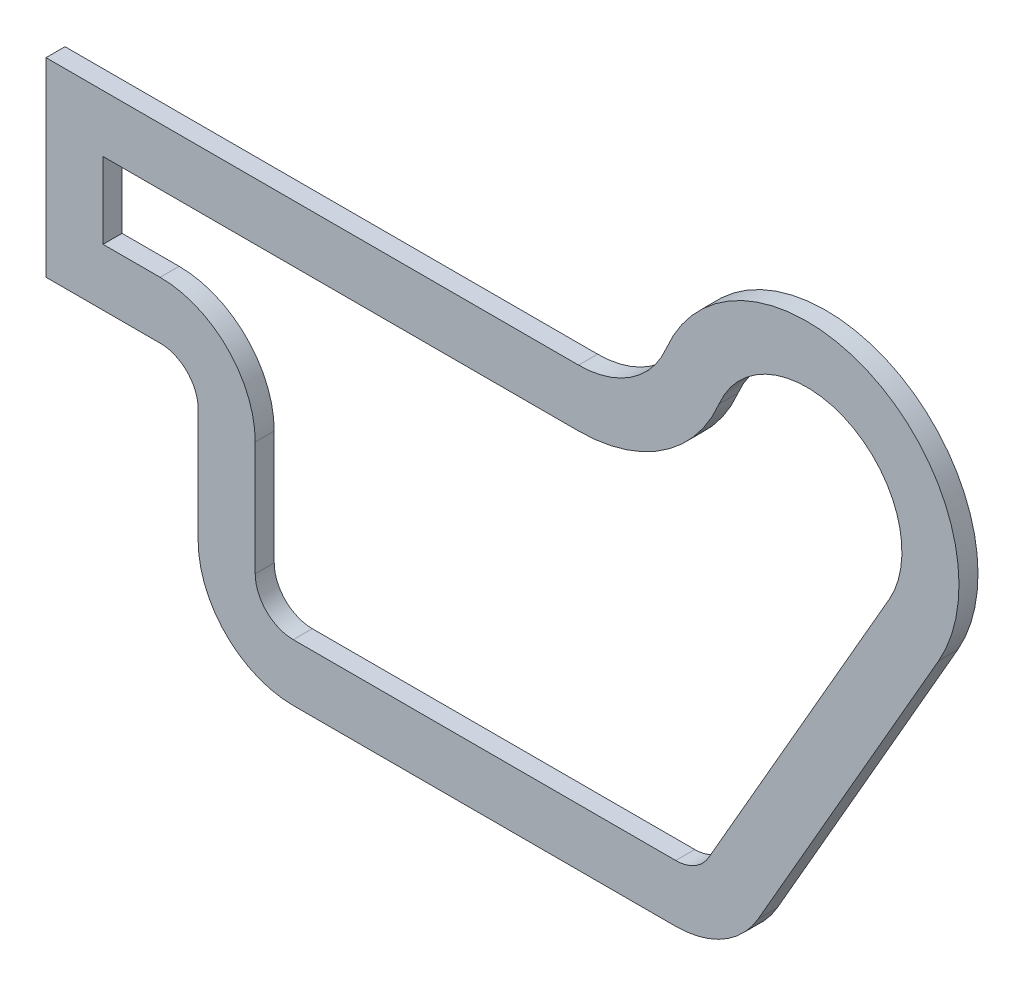
ISO-10303-21;
HEADER;
FILE_DESCRIPTION(('STEP AP214'),'2;1');
FILE_NAME('part.step','',(''),(''),'','','');
FILE_SCHEMA(('AUTOMOTIVE_DESIGN { 1 0 10303 214 1 1 1 1 }'));
ENDSEC;
DATA;
#1=APPLICATION_CONTEXT('core data for automotive mechanical design processes');
#2=APPLICATION_PROTOCOL_DEFINITION('international standard','automotive_design',2000,#1);
#3=PRODUCT_CONTEXT('',#1,'mechanical');
#4=PRODUCT('Part','Part','',(#3));
#5=PRODUCT_RELATED_PRODUCT_CATEGORY('part','',(#4));
#6=PRODUCT_DEFINITION_FORMATION('','',#4);
#7=PRODUCT_DEFINITION_CONTEXT('part definition',#1,'design');
#8=PRODUCT_DEFINITION('design','',#6,#7);
#9=PRODUCT_DEFINITION_SHAPE('','',#8);
#10=(LENGTH_UNIT() NAMED_UNIT(*) SI_UNIT(.MILLI.,.METRE.));
#11=(NAMED_UNIT(*) PLANE_ANGLE_UNIT() SI_UNIT($,.RADIAN.));
#12=(NAMED_UNIT(*) SI_UNIT($,.STERADIAN.) SOLID_ANGLE_UNIT());
#13=UNCERTAINTY_MEASURE_WITH_UNIT(LENGTH_MEASURE(1.E-05),#10,'distance_accuracy_value','');
#14=(GEOMETRIC_REPRESENTATION_CONTEXT(3) GLOBAL_UNCERTAINTY_ASSIGNED_CONTEXT((#13)) GLOBAL_UNIT_ASSIGNED_CONTEXT((#10,
#11,#12)) REPRESENTATION_CONTEXT('',''));
#15=CARTESIAN_POINT('',(0.,0.,0.));
#16=DIRECTION('',(0.,0.,1.));
#17=DIRECTION('',(1.,0.,0.));
#18=AXIS2_PLACEMENT_3D('',#15,#16,#17);
#19=CARTESIAN_POINT('',(140.,140.,0.));
#20=DIRECTION('',(0.,0.,-1.));
#21=DIRECTION('',(-1.,0.,0.));
#22=AXIS2_PLACEMENT_3D('',#19,#20,#21);
#23=PLANE('',#22);
#24=CARTESIAN_POINT('',(140.,140.,0.));
#25=DIRECTION('',(0.,0.,-1.));
#26=DIRECTION('',(-1.,0.,0.));
#27=AXIS2_PLACEMENT_3D('',#24,#25,#26);
#28=CIRCLE('',#27,25.);
#29=CARTESIAN_POINT('',(163.076923076923,130.384615384615,0.));
#30=VERTEX_POINT('',#29);
#31=CARTESIAN_POINT('',(140.,115.,0.));
#32=VERTEX_POINT('',#31);
#33=EDGE_CURVE('E322',#30,#32,#28,.T.);
#34=ORIENTED_EDGE('',*,*,#33,.F.);
#35=CARTESIAN_POINT('',(200.,115.,0.));
#36=DIRECTION('',(0.,0.,1.));
#37=DIRECTION('',(1.,0.,0.));
#38=AXIS2_PLACEMENT_3D('',#35,#36,#37);
#39=CIRCLE('',#38,40.);
#40=CARTESIAN_POINT('',(234.67371600643,95.05674504236,0.));
#41=VERTEX_POINT('',#40);
#42=EDGE_CURVE('E288',#41,#30,#39,.T.);
#43=ORIENTED_EDGE('',*,*,#42,.F.);
#44=DIRECTION('',(0.498581373941,0.866842900160752,0.));
#45=VECTOR('',#44,1.);
#46=CARTESIAN_POINT('',(187.210014278647,12.5354656514751,0.));
#47=LINE('',#46,#45);
#48=CARTESIAN_POINT('',(187.210014278647,12.5354656514751,0.));
#49=VERTEX_POINT('',#48);
#50=EDGE_CURVE('E356',#49,#41,#47,.T.);
#51=ORIENTED_EDGE('',*,*,#50,.F.);
#52=CARTESIAN_POINT('',(165.538941774628,25.,0.));
#53=DIRECTION('',(0.,0.,-1.));
#54=DIRECTION('',(-1.,0.,0.));
#55=AXIS2_PLACEMENT_3D('',#52,#53,#54);
#56=CIRCLE('',#55,25.);
#57=CARTESIAN_POINT('',(165.538941774628,0.,0.));
#58=VERTEX_POINT('',#57);
#59=EDGE_CURVE('E352',#49,#58,#56,.T.);
#60=ORIENTED_EDGE('',*,*,#59,.T.);
#61=DIRECTION('',(1.,0.,0.));
#62=VECTOR('',#61,1.);
#63=CARTESIAN_POINT('',(65.0000000000002,0.,0.));
#64=LINE('',#63,#62);
#65=CARTESIAN_POINT('',(65.0000000000002,0.,0.));
#66=VERTEX_POINT('',#65);
#67=EDGE_CURVE('E348',#66,#58,#64,.T.);
#68=ORIENTED_EDGE('',*,*,#67,.F.);
#69=CARTESIAN_POINT('',(65.,25.,0.));
#70=DIRECTION('',(0.,0.,-1.));
#71=DIRECTION('',(-1.,0.,0.));
#72=AXIS2_PLACEMENT_3D('',#69,#70,#71);
#73=CIRCLE('',#72,25.);
#74=CARTESIAN_POINT('',(40.,25.0000000000002,0.));
#75=VERTEX_POINT('',#74);
#76=EDGE_CURVE('E344',#66,#75,#73,.T.);
#77=ORIENTED_EDGE('',*,*,#76,.T.);
#78=DIRECTION('',(0.,-1.,0.));
#79=VECTOR('',#78,1.);
#80=CARTESIAN_POINT('',(40.,54.9999999999999,0.));
#81=LINE('',#80,#79);
#82=CARTESIAN_POINT('',(40.,54.9999999999999,0.));
#83=VERTEX_POINT('',#82);
#84=EDGE_CURVE('E340',#83,#75,#81,.T.);
#85=ORIENTED_EDGE('',*,*,#84,.F.);
#86=CARTESIAN_POINT('',(30.,55.,0.));
#87=DIRECTION('',(0.,0.,1.));
#88=DIRECTION('',(1.,0.,0.));
#89=AXIS2_PLACEMENT_3D('',#86,#87,#88);
#90=CIRCLE('',#89,10.);
#91=CARTESIAN_POINT('',(29.9999999999999,65.,0.));
#92=VERTEX_POINT('',#91);
#93=EDGE_CURVE('E336',#83,#92,#90,.T.);
#94=ORIENTED_EDGE('',*,*,#93,.T.);
#95=DIRECTION('',(1.,0.,0.));
#96=VECTOR('',#95,1.);
#97=CARTESIAN_POINT('',(0.,65.,0.));
#98=LINE('',#97,#96);
#99=CARTESIAN_POINT('',(0.,65.,0.));
#100=VERTEX_POINT('',#99);
#101=EDGE_CURVE('E332',#100,#92,#98,.T.);
#102=ORIENTED_EDGE('',*,*,#101,.F.);
#103=DIRECTION('',(0.,-1.,0.));
#104=VECTOR('',#103,1.);
#105=CARTESIAN_POINT('',(0.,115.,0.));
#106=LINE('',#105,#104);
#107=CARTESIAN_POINT('',(0.,115.,0.));
#108=VERTEX_POINT('',#107);
#109=EDGE_CURVE('E329',#108,#100,#106,.T.);
#110=ORIENTED_EDGE('',*,*,#109,.F.);
#111=DIRECTION('',(-1.,0.,0.));
#112=VECTOR('',#111,1.);
#113=CARTESIAN_POINT('',(140.,115.,0.));
#114=LINE('',#113,#112);
#115=EDGE_CURVE('E326',#32,#108,#114,.T.);
#116=ORIENTED_EDGE('',*,*,#115,.F.);
#117=EDGE_LOOP('',(#34,#43,#51,#60,#68,#77,#85,#94,#102,#110,#116));
#118=FACE_BOUND('',#117,.T.);
#119=CARTESIAN_POINT('',(200.,115.,0.));
#120=DIRECTION('',(0.,0.,-1.));
#121=DIRECTION('',(-1.,0.,0.));
#122=AXIS2_PLACEMENT_3D('',#119,#120,#121);
#123=CIRCLE('',#122,25.);
#124=CARTESIAN_POINT('',(221.671072504019,102.535465651475,0.));
#125=VERTEX_POINT('',#124);
#126=CARTESIAN_POINT('',(176.923076923077,124.615384615385,0.));
#127=VERTEX_POINT('',#126);
#128=EDGE_CURVE('E192',#125,#127,#123,.F.);
#129=ORIENTED_EDGE('',*,*,#128,.T.);
#130=CARTESIAN_POINT('',(140.,140.,0.));
#131=DIRECTION('',(0.,0.,-1.));
#132=DIRECTION('',(-1.,0.,0.));
#133=AXIS2_PLACEMENT_3D('',#130,#131,#132);
#134=CIRCLE('',#133,40.);
#135=CARTESIAN_POINT('',(140.,100.,0.));
#136=VERTEX_POINT('',#135);
#137=EDGE_CURVE('E202',#127,#136,#134,.T.);
#138=ORIENTED_EDGE('',*,*,#137,.T.);
#139=DIRECTION('',(-1.,0.,0.));
#140=VECTOR('',#139,1.);
#141=CARTESIAN_POINT('',(140.,100.,0.));
#142=LINE('',#141,#140);
#143=CARTESIAN_POINT('',(15.,100.,0.));
#144=VERTEX_POINT('',#143);
#145=EDGE_CURVE('E209',#136,#144,#142,.T.);
#146=ORIENTED_EDGE('',*,*,#145,.T.);
#147=DIRECTION('',(0.,-1.,0.));
#148=VECTOR('',#147,1.);
#149=CARTESIAN_POINT('',(15.,140.,0.));
#150=LINE('',#149,#148);
#151=CARTESIAN_POINT('',(15.,80.,0.));
#152=VERTEX_POINT('',#151);
#153=EDGE_CURVE('E63',#144,#152,#150,.T.);
#154=ORIENTED_EDGE('',*,*,#153,.T.);
#155=DIRECTION('',(1.,0.,0.));
#156=VECTOR('',#155,1.);
#157=CARTESIAN_POINT('',(140.,80.,0.));
#158=LINE('',#157,#156);
#159=CARTESIAN_POINT('',(29.9999999999998,80.,0.));
#160=VERTEX_POINT('',#159);
#161=EDGE_CURVE('E244',#152,#160,#158,.T.);
#162=ORIENTED_EDGE('',*,*,#161,.T.);
#163=CARTESIAN_POINT('',(30.,55.,0.));
#164=DIRECTION('',(0.,0.,-1.));
#165=DIRECTION('',(-1.,0.,0.));
#166=AXIS2_PLACEMENT_3D('',#163,#164,#165);
#167=CIRCLE('',#166,25.);
#168=CARTESIAN_POINT('',(55.,54.9999999999999,0.));
#169=VERTEX_POINT('',#168);
#170=EDGE_CURVE('E240',#169,#160,#167,.F.);
#171=ORIENTED_EDGE('',*,*,#170,.F.);
#172=DIRECTION('',(0.,-1.,0.));
#173=VECTOR('',#172,1.);
#174=CARTESIAN_POINT('',(55.,140.,0.));
#175=LINE('',#174,#173);
#176=CARTESIAN_POINT('',(55.,25.0000000000001,0.));
#177=VERTEX_POINT('',#176);
#178=EDGE_CURVE('E236',#169,#177,#175,.T.);
#179=ORIENTED_EDGE('',*,*,#178,.T.);
#180=CARTESIAN_POINT('',(65.,25.,0.));
#181=DIRECTION('',(0.,0.,-1.));
#182=DIRECTION('',(-1.,0.,0.));
#183=AXIS2_PLACEMENT_3D('',#180,#181,#182);
#184=CIRCLE('',#183,10.);
#185=CARTESIAN_POINT('',(65.0000000000002,15.,0.));
#186=VERTEX_POINT('',#185);
#187=EDGE_CURVE('E232',#186,#177,#184,.T.);
#188=ORIENTED_EDGE('',*,*,#187,.F.);
#189=DIRECTION('',(1.,0.,0.));
#190=VECTOR('',#189,1.);
#191=CARTESIAN_POINT('',(140.,15.,0.));
#192=LINE('',#191,#190);
#193=CARTESIAN_POINT('',(165.538941774628,15.,0.));
#194=VERTEX_POINT('',#193);
#195=EDGE_CURVE('E228',#186,#194,#192,.T.);
#196=ORIENTED_EDGE('',*,*,#195,.T.);
#197=CARTESIAN_POINT('',(165.538941774628,25.,0.));
#198=DIRECTION('',(0.,0.,-1.));
#199=DIRECTION('',(-1.,0.,0.));
#200=AXIS2_PLACEMENT_3D('',#197,#198,#199);
#201=CIRCLE('',#200,10.);
#202=CARTESIAN_POINT('',(174.207370776236,20.0141862605901,0.));
#203=VERTEX_POINT('',#202);
#204=EDGE_CURVE('E221',#203,#194,#201,.T.);
#205=ORIENTED_EDGE('',*,*,#204,.F.);
#206=DIRECTION('',(0.498581373941,0.866842900160752,0.));
#207=VECTOR('',#206,1.);
#208=CARTESIAN_POINT('',(217.560862421394,95.3893775412636,0.));
#209=LINE('',#208,#207);
#210=EDGE_CURVE('E213',#203,#125,#209,.T.);
#211=ORIENTED_EDGE('',*,*,#210,.T.);
#212=EDGE_LOOP('',(#129,#138,#146,#154,#162,#171,#179,#188,#196,#205,#211));
#213=FACE_BOUND('',#212,.T.);
#214=ADVANCED_FACE('F39',(#118,#213),#23,.T.);
#215=CARTESIAN_POINT('',(140.,140.,5.));
#216=DIRECTION('',(0.,0.,-1.));
#217=DIRECTION('',(-1.,0.,0.));
#218=AXIS2_PLACEMENT_3D('',#215,#216,#217);
#219=CYLINDRICAL_SURFACE('',#218,25.);
#220=ORIENTED_EDGE('',*,*,#33,.T.);
#221=DIRECTION('',(0.,0.,-1.));
#222=VECTOR('',#221,1.);
#223=CARTESIAN_POINT('',(140.,115.,5.));
#224=LINE('',#223,#222);
#225=CARTESIAN_POINT('',(140.,115.,5.));
#226=VERTEX_POINT('',#225);
#227=EDGE_CURVE('E11',#226,#32,#224,.T.);
#228=ORIENTED_EDGE('',*,*,#227,.F.);
#229=CARTESIAN_POINT('',(140.,140.,5.));
#230=DIRECTION('',(0.,0.,-1.));
#231=DIRECTION('',(-1.,0.,0.));
#232=AXIS2_PLACEMENT_3D('',#229,#230,#231);
#233=CIRCLE('',#232,25.);
#234=CARTESIAN_POINT('',(163.076923076923,130.384615384615,5.));
#235=VERTEX_POINT('',#234);
#236=EDGE_CURVE('E283',#235,#226,#233,.T.);
#237=ORIENTED_EDGE('',*,*,#236,.F.);
#238=DIRECTION('',(0.,0.,-1.));
#239=VECTOR('',#238,1.);
#240=CARTESIAN_POINT('',(163.076923076923,130.384615384615,5.));
#241=LINE('',#240,#239);
#242=EDGE_CURVE('E321',#235,#30,#241,.T.);
#243=ORIENTED_EDGE('',*,*,#242,.T.);
#244=EDGE_LOOP('',(#220,#228,#237,#243));
#245=FACE_BOUND('',#244,.T.);
#246=ADVANCED_FACE('F41',(#245),#219,.F.);
#247=CARTESIAN_POINT('',(140.,115.,5.));
#248=DIRECTION('',(0.,-1.,0.));
#249=DIRECTION('',(0.,0.,-1.));
#250=AXIS2_PLACEMENT_3D('',#247,#248,#249);
#251=PLANE('',#250);
#252=ORIENTED_EDGE('',*,*,#115,.T.);
#253=DIRECTION('',(0.,0.,-1.));
#254=VECTOR('',#253,1.);
#255=CARTESIAN_POINT('',(0.,115.,5.));
#256=LINE('',#255,#254);
#257=CARTESIAN_POINT('',(0.,115.,5.));
#258=VERTEX_POINT('',#257);
#259=EDGE_CURVE('E48',#258,#108,#256,.T.);
#260=ORIENTED_EDGE('',*,*,#259,.F.);
#261=DIRECTION('',(-1.,0.,0.));
#262=VECTOR('',#261,1.);
#263=CARTESIAN_POINT('',(140.,115.,5.));
#264=LINE('',#263,#262);
#265=EDGE_CURVE('E287',#226,#258,#264,.T.);
#266=ORIENTED_EDGE('',*,*,#265,.F.);
#267=ORIENTED_EDGE('',*,*,#227,.T.);
#268=EDGE_LOOP('',(#252,#260,#266,#267));
#269=FACE_BOUND('',#268,.T.);
#270=ADVANCED_FACE('F412',(#269),#251,.F.);
#271=CARTESIAN_POINT('',(0.,115.,5.));
#272=DIRECTION('',(1.,0.,0.));
#273=DIRECTION('',(0.,1.,0.));
#274=AXIS2_PLACEMENT_3D('',#271,#272,#273);
#275=PLANE('',#274);
#276=ORIENTED_EDGE('',*,*,#109,.T.);
#277=DIRECTION('',(0.,0.,-1.));
#278=VECTOR('',#277,1.);
#279=CARTESIAN_POINT('',(0.,65.,5.));
#280=LINE('',#279,#278);
#281=CARTESIAN_POINT('',(0.,65.,5.));
#282=VERTEX_POINT('',#281);
#283=EDGE_CURVE('E386',#282,#100,#280,.T.);
#284=ORIENTED_EDGE('',*,*,#283,.F.);
#285=DIRECTION('',(0.,-1.,0.));
#286=VECTOR('',#285,1.);
#287=CARTESIAN_POINT('',(0.,115.,5.));
#288=LINE('',#287,#286);
#289=EDGE_CURVE('E291',#258,#282,#288,.T.);
#290=ORIENTED_EDGE('',*,*,#289,.F.);
#291=ORIENTED_EDGE('',*,*,#259,.T.);
#292=EDGE_LOOP('',(#276,#284,#290,#291));
#293=FACE_BOUND('',#292,.T.);
#294=ADVANCED_FACE('F395',(#293),#275,.F.);
#295=CARTESIAN_POINT('',(0.,65.,5.));
#296=DIRECTION('',(0.,1.,0.));
#297=DIRECTION('',(0.,0.,1.));
#298=AXIS2_PLACEMENT_3D('',#295,#296,#297);
#299=PLANE('',#298);
#300=ORIENTED_EDGE('',*,*,#101,.T.);
#301=DIRECTION('',(0.,0.,-1.));
#302=VECTOR('',#301,1.);
#303=CARTESIAN_POINT('',(29.9999999999999,65.,5.));
#304=LINE('',#303,#302);
#305=CARTESIAN_POINT('',(29.9999999999999,65.,5.));
#306=VERTEX_POINT('',#305);
#307=EDGE_CURVE('E383',#306,#92,#304,.T.);
#308=ORIENTED_EDGE('',*,*,#307,.F.);
#309=DIRECTION('',(1.,0.,0.));
#310=VECTOR('',#309,1.);
#311=CARTESIAN_POINT('',(0.,65.,5.));
#312=LINE('',#311,#310);
#313=EDGE_CURVE('E294',#282,#306,#312,.T.);
#314=ORIENTED_EDGE('',*,*,#313,.F.);
#315=ORIENTED_EDGE('',*,*,#283,.T.);
#316=EDGE_LOOP('',(#300,#308,#314,#315));
#317=FACE_BOUND('',#316,.T.);
#318=ADVANCED_FACE('F405',(#317),#299,.F.);
#319=CARTESIAN_POINT('',(30.,55.,5.));
#320=DIRECTION('',(0.,0.,-1.));
#321=DIRECTION('',(-1.,0.,0.));
#322=AXIS2_PLACEMENT_3D('',#319,#320,#321);
#323=CYLINDRICAL_SURFACE('',#322,10.);
#324=ORIENTED_EDGE('',*,*,#93,.F.);
#325=DIRECTION('',(0.,0.,-1.));
#326=VECTOR('',#325,1.);
#327=CARTESIAN_POINT('',(40.,54.9999999999999,5.));
#328=LINE('',#327,#326);
#329=CARTESIAN_POINT('',(40.,54.9999999999999,5.));
#330=VERTEX_POINT('',#329);
#331=EDGE_CURVE('E380',#330,#83,#328,.T.);
#332=ORIENTED_EDGE('',*,*,#331,.F.);
#333=CARTESIAN_POINT('',(30.,55.,5.));
#334=DIRECTION('',(0.,0.,1.));
#335=DIRECTION('',(1.,0.,0.));
#336=AXIS2_PLACEMENT_3D('',#333,#334,#335);
#337=CIRCLE('',#336,10.);
#338=EDGE_CURVE('E297',#330,#306,#337,.T.);
#339=ORIENTED_EDGE('',*,*,#338,.T.);
#340=ORIENTED_EDGE('',*,*,#307,.T.);
#341=EDGE_LOOP('',(#324,#332,#339,#340));
#342=FACE_BOUND('',#341,.T.);
#343=ADVANCED_FACE('F441',(#342),#323,.F.);
#344=CARTESIAN_POINT('',(40.,54.9999999999999,5.));
#345=DIRECTION('',(1.,0.,0.));
#346=DIRECTION('',(0.,1.,0.));
#347=AXIS2_PLACEMENT_3D('',#344,#345,#346);
#348=PLANE('',#347);
#349=ORIENTED_EDGE('',*,*,#84,.T.);
#350=DIRECTION('',(0.,0.,-1.));
#351=VECTOR('',#350,1.);
#352=CARTESIAN_POINT('',(40.,25.0000000000002,5.));
#353=LINE('',#352,#351);
#354=CARTESIAN_POINT('',(40.,25.0000000000002,5.));
#355=VERTEX_POINT('',#354);
#356=EDGE_CURVE('E377',#355,#75,#353,.T.);
#357=ORIENTED_EDGE('',*,*,#356,.F.);
#358=DIRECTION('',(0.,-1.,0.));
#359=VECTOR('',#358,1.);
#360=CARTESIAN_POINT('',(40.,54.9999999999999,5.));
#361=LINE('',#360,#359);
#362=EDGE_CURVE('E301',#330,#355,#361,.T.);
#363=ORIENTED_EDGE('',*,*,#362,.F.);
#364=ORIENTED_EDGE('',*,*,#331,.T.);
#365=EDGE_LOOP('',(#349,#357,#363,#364));
#366=FACE_BOUND('',#365,.T.);
#367=ADVANCED_FACE('F439',(#366),#348,.F.);
#368=CARTESIAN_POINT('',(65.,25.,5.));
#369=DIRECTION('',(0.,0.,-1.));
#370=DIRECTION('',(-1.,0.,0.));
#371=AXIS2_PLACEMENT_3D('',#368,#369,#370);
#372=CYLINDRICAL_SURFACE('',#371,25.);
#373=ORIENTED_EDGE('',*,*,#76,.F.);
#374=DIRECTION('',(0.,0.,-1.));
#375=VECTOR('',#374,1.);
#376=CARTESIAN_POINT('',(65.0000000000002,0.,5.));
#377=LINE('',#376,#375);
#378=CARTESIAN_POINT('',(65.0000000000002,0.,5.));
#379=VERTEX_POINT('',#378);
#380=EDGE_CURVE('E374',#379,#66,#377,.T.);
#381=ORIENTED_EDGE('',*,*,#380,.F.);
#382=CARTESIAN_POINT('',(65.,25.,5.));
#383=DIRECTION('',(0.,0.,-1.));
#384=DIRECTION('',(-1.,0.,0.));
#385=AXIS2_PLACEMENT_3D('',#382,#383,#384);
#386=CIRCLE('',#385,25.);
#387=EDGE_CURVE('E304',#379,#355,#386,.T.);
#388=ORIENTED_EDGE('',*,*,#387,.T.);
#389=ORIENTED_EDGE('',*,*,#356,.T.);
#390=EDGE_LOOP('',(#373,#381,#388,#389));
#391=FACE_BOUND('',#390,.T.);
#392=ADVANCED_FACE('F433',(#391),#372,.T.);
#393=CARTESIAN_POINT('',(65.0000000000002,0.,5.));
#394=DIRECTION('',(0.,1.,0.));
#395=DIRECTION('',(0.,0.,1.));
#396=AXIS2_PLACEMENT_3D('',#393,#394,#395);
#397=PLANE('',#396);
#398=ORIENTED_EDGE('',*,*,#67,.T.);
#399=DIRECTION('',(0.,0.,-1.));
#400=VECTOR('',#399,1.);
#401=CARTESIAN_POINT('',(165.538941774628,0.,5.));
#402=LINE('',#401,#400);
#403=CARTESIAN_POINT('',(165.538941774628,0.,5.));
#404=VERTEX_POINT('',#403);
#405=EDGE_CURVE('E371',#404,#58,#402,.T.);
#406=ORIENTED_EDGE('',*,*,#405,.F.);
#407=DIRECTION('',(1.,0.,0.));
#408=VECTOR('',#407,1.);
#409=CARTESIAN_POINT('',(65.0000000000002,0.,5.));
#410=LINE('',#409,#408);
#411=EDGE_CURVE('E308',#379,#404,#410,.T.);
#412=ORIENTED_EDGE('',*,*,#411,.F.);
#413=ORIENTED_EDGE('',*,*,#380,.T.);
#414=EDGE_LOOP('',(#398,#406,#412,#413));
#415=FACE_BOUND('',#414,.T.);
#416=ADVANCED_FACE('F442',(#415),#397,.F.);
#417=CARTESIAN_POINT('',(165.538941774628,25.,5.));
#418=DIRECTION('',(0.,0.,-1.));
#419=DIRECTION('',(-1.,0.,0.));
#420=AXIS2_PLACEMENT_3D('',#417,#418,#419);
#421=CYLINDRICAL_SURFACE('',#420,25.);
#422=ORIENTED_EDGE('',*,*,#59,.F.);
#423=DIRECTION('',(0.,0.,-1.));
#424=VECTOR('',#423,1.);
#425=CARTESIAN_POINT('',(187.210014278647,12.5354656514751,5.));
#426=LINE('',#425,#424);
#427=CARTESIAN_POINT('',(187.210014278647,12.5354656514751,5.));
#428=VERTEX_POINT('',#427);
#429=EDGE_CURVE('E368',#428,#49,#426,.T.);
#430=ORIENTED_EDGE('',*,*,#429,.F.);
#431=CARTESIAN_POINT('',(165.538941774628,25.,5.));
#432=DIRECTION('',(0.,0.,-1.));
#433=DIRECTION('',(-1.,0.,0.));
#434=AXIS2_PLACEMENT_3D('',#431,#432,#433);
#435=CIRCLE('',#434,25.);
#436=EDGE_CURVE('E311',#428,#404,#435,.T.);
#437=ORIENTED_EDGE('',*,*,#436,.T.);
#438=ORIENTED_EDGE('',*,*,#405,.T.);
#439=EDGE_LOOP('',(#422,#430,#437,#438));
#440=FACE_BOUND('',#439,.T.);
#441=ADVANCED_FACE('F427',(#440),#421,.T.);
#442=CARTESIAN_POINT('',(187.210014278647,12.5354656514751,5.));
#443=DIRECTION('',(-0.866842900160752,0.498581373941,0.));
#444=DIRECTION('',(-0.498581373941,-0.866842900160752,0.));
#445=AXIS2_PLACEMENT_3D('',#442,#443,#444);
#446=PLANE('',#445);
#447=ORIENTED_EDGE('',*,*,#50,.T.);
#448=DIRECTION('',(0.,0.,-1.));
#449=VECTOR('',#448,1.);
#450=CARTESIAN_POINT('',(234.67371600643,95.05674504236,5.));
#451=LINE('',#450,#449);
#452=CARTESIAN_POINT('',(234.67371600643,95.05674504236,5.));
#453=VERTEX_POINT('',#452);
#454=EDGE_CURVE('E364',#453,#41,#451,.T.);
#455=ORIENTED_EDGE('',*,*,#454,.F.);
#456=DIRECTION('',(0.498581373941,0.866842900160752,0.));
#457=VECTOR('',#456,1.);
#458=CARTESIAN_POINT('',(187.210014278647,12.5354656514751,5.));
#459=LINE('',#458,#457);
#460=EDGE_CURVE('E315',#428,#453,#459,.T.);
#461=ORIENTED_EDGE('',*,*,#460,.F.);
#462=ORIENTED_EDGE('',*,*,#429,.T.);
#463=EDGE_LOOP('',(#447,#455,#461,#462));
#464=FACE_BOUND('',#463,.T.);
#465=ADVANCED_FACE('F424',(#464),#446,.F.);
#466=CARTESIAN_POINT('',(200.,115.,5.));
#467=DIRECTION('',(0.,0.,-1.));
#468=DIRECTION('',(-1.,0.,0.));
#469=AXIS2_PLACEMENT_3D('',#466,#467,#468);
#470=CYLINDRICAL_SURFACE('',#469,40.);
#471=ORIENTED_EDGE('',*,*,#42,.T.);
#472=ORIENTED_EDGE('',*,*,#242,.F.);
#473=CARTESIAN_POINT('',(200.,115.,5.));
#474=DIRECTION('',(0.,0.,1.));
#475=DIRECTION('',(1.,0.,0.));
#476=AXIS2_PLACEMENT_3D('',#473,#474,#475);
#477=CIRCLE('',#476,40.);
#478=EDGE_CURVE('E318',#453,#235,#477,.T.);
#479=ORIENTED_EDGE('',*,*,#478,.F.);
#480=ORIENTED_EDGE('',*,*,#454,.T.);
#481=EDGE_LOOP('',(#471,#472,#479,#480));
#482=FACE_BOUND('',#481,.T.);
#483=ADVANCED_FACE('F419',(#482),#470,.T.);
#484=CARTESIAN_POINT('',(140.,140.,5.));
#485=DIRECTION('',(0.,0.,-1.));
#486=DIRECTION('',(-1.,0.,0.));
#487=AXIS2_PLACEMENT_3D('',#484,#485,#486);
#488=PLANE('',#487);
#489=CARTESIAN_POINT('',(140.,140.,5.));
#490=DIRECTION('',(0.,0.,-1.));
#491=DIRECTION('',(-1.,0.,0.));
#492=AXIS2_PLACEMENT_3D('',#489,#490,#491);
#493=CIRCLE('',#492,40.);
#494=CARTESIAN_POINT('',(176.923076923077,124.615384615385,5.));
#495=VERTEX_POINT('',#494);
#496=CARTESIAN_POINT('',(140.,100.,5.));
#497=VERTEX_POINT('',#496);
#498=EDGE_CURVE('E215',#495,#497,#493,.T.);
#499=ORIENTED_EDGE('',*,*,#498,.F.);
#500=CARTESIAN_POINT('',(200.,115.,5.));
#501=DIRECTION('',(0.,0.,-1.));
#502=DIRECTION('',(-1.,0.,0.));
#503=AXIS2_PLACEMENT_3D('',#500,#501,#502);
#504=CIRCLE('',#503,25.);
#505=CARTESIAN_POINT('',(221.671072504019,102.535465651475,5.));
#506=VERTEX_POINT('',#505);
#507=EDGE_CURVE('E195',#506,#495,#504,.F.);
#508=ORIENTED_EDGE('',*,*,#507,.F.);
#509=DIRECTION('',(0.498581373941,0.866842900160752,0.));
#510=VECTOR('',#509,1.);
#511=CARTESIAN_POINT('',(217.560862421394,95.3893775412636,5.));
#512=LINE('',#511,#510);
#513=CARTESIAN_POINT('',(174.207370776236,20.01418626059,5.));
#514=VERTEX_POINT('',#513);
#515=EDGE_CURVE('E278',#514,#506,#512,.T.);
#516=ORIENTED_EDGE('',*,*,#515,.F.);
#517=CARTESIAN_POINT('',(165.538941774628,25.,5.));
#518=DIRECTION('',(0.,0.,-1.));
#519=DIRECTION('',(-1.,0.,0.));
#520=AXIS2_PLACEMENT_3D('',#517,#518,#519);
#521=CIRCLE('',#520,10.);
#522=CARTESIAN_POINT('',(165.538941774628,15.,5.));
#523=VERTEX_POINT('',#522);
#524=EDGE_CURVE('E274',#514,#523,#521,.T.);
#525=ORIENTED_EDGE('',*,*,#524,.T.);
#526=DIRECTION('',(1.,0.,0.));
#527=VECTOR('',#526,1.);
#528=CARTESIAN_POINT('',(140.,15.,5.));
#529=LINE('',#528,#527);
#530=CARTESIAN_POINT('',(65.0000000000001,15.,5.));
#531=VERTEX_POINT('',#530);
#532=EDGE_CURVE('E271',#531,#523,#529,.T.);
#533=ORIENTED_EDGE('',*,*,#532,.F.);
#534=CARTESIAN_POINT('',(65.,25.,5.));
#535=DIRECTION('',(0.,0.,-1.));
#536=DIRECTION('',(-1.,0.,0.));
#537=AXIS2_PLACEMENT_3D('',#534,#535,#536);
#538=CIRCLE('',#537,10.);
#539=CARTESIAN_POINT('',(55.,25.0000000000002,5.));
#540=VERTEX_POINT('',#539);
#541=EDGE_CURVE('E267',#531,#540,#538,.T.);
#542=ORIENTED_EDGE('',*,*,#541,.T.);
#543=DIRECTION('',(0.,-1.,0.));
#544=VECTOR('',#543,1.);
#545=CARTESIAN_POINT('',(55.,140.,5.));
#546=LINE('',#545,#544);
#547=CARTESIAN_POINT('',(55.,54.9999999999998,5.));
#548=VERTEX_POINT('',#547);
#549=EDGE_CURVE('E264',#548,#540,#546,.T.);
#550=ORIENTED_EDGE('',*,*,#549,.F.);
#551=CARTESIAN_POINT('',(30.,55.,5.));
#552=DIRECTION('',(0.,0.,-1.));
#553=DIRECTION('',(-1.,0.,0.));
#554=AXIS2_PLACEMENT_3D('',#551,#552,#553);
#555=CIRCLE('',#554,25.);
#556=CARTESIAN_POINT('',(29.9999999999999,80.,5.));
#557=VERTEX_POINT('',#556);
#558=EDGE_CURVE('E260',#548,#557,#555,.F.);
#559=ORIENTED_EDGE('',*,*,#558,.T.);
#560=DIRECTION('',(1.,0.,0.));
#561=VECTOR('',#560,1.);
#562=CARTESIAN_POINT('',(140.,80.,5.));
#563=LINE('',#562,#561);
#564=CARTESIAN_POINT('',(15.,80.,5.));
#565=VERTEX_POINT('',#564);
#566=EDGE_CURVE('E257',#565,#557,#563,.T.);
#567=ORIENTED_EDGE('',*,*,#566,.F.);
#568=DIRECTION('',(0.,-1.,0.));
#569=VECTOR('',#568,1.);
#570=CARTESIAN_POINT('',(15.,140.,5.));
#571=LINE('',#570,#569);
#572=CARTESIAN_POINT('',(15.,100.,5.));
#573=VERTEX_POINT('',#572);
#574=EDGE_CURVE('E254',#573,#565,#571,.T.);
#575=ORIENTED_EDGE('',*,*,#574,.F.);
#576=DIRECTION('',(-1.,0.,0.));
#577=VECTOR('',#576,1.);
#578=CARTESIAN_POINT('',(140.,100.,5.));
#579=LINE('',#578,#577);
#580=EDGE_CURVE('E219',#497,#573,#579,.T.);
#581=ORIENTED_EDGE('',*,*,#580,.F.);
#582=EDGE_LOOP('',(#499,#508,#516,#525,#533,#542,#550,#559,#567,#575,#581));
#583=FACE_BOUND('',#582,.T.);
#584=ORIENTED_EDGE('',*,*,#236,.T.);
#585=ORIENTED_EDGE('',*,*,#265,.T.);
#586=ORIENTED_EDGE('',*,*,#289,.T.);
#587=ORIENTED_EDGE('',*,*,#313,.T.);
#588=ORIENTED_EDGE('',*,*,#338,.F.);
#589=ORIENTED_EDGE('',*,*,#362,.T.);
#590=ORIENTED_EDGE('',*,*,#387,.F.);
#591=ORIENTED_EDGE('',*,*,#411,.T.);
#592=ORIENTED_EDGE('',*,*,#436,.F.);
#593=ORIENTED_EDGE('',*,*,#460,.T.);
#594=ORIENTED_EDGE('',*,*,#478,.T.);
#595=EDGE_LOOP('',(#584,#585,#586,#587,#588,#589,#590,#591,#592,#593,#594));
#596=FACE_BOUND('',#595,.T.);
#597=ADVANCED_FACE('F409',(#583,#596),#488,.F.);
#598=CARTESIAN_POINT('',(140.,140.,5.));
#599=DIRECTION('',(0.,0.,-1.));
#600=DIRECTION('',(-1.,0.,0.));
#601=AXIS2_PLACEMENT_3D('',#598,#599,#600);
#602=CYLINDRICAL_SURFACE('',#601,40.);
#603=ORIENTED_EDGE('',*,*,#137,.F.);
#604=DIRECTION('',(0.,0.,-1.));
#605=VECTOR('',#604,1.);
#606=CARTESIAN_POINT('',(176.923076923077,124.615384615385,5.));
#607=LINE('',#606,#605);
#608=EDGE_CURVE('E188',#495,#127,#607,.T.);
#609=ORIENTED_EDGE('',*,*,#608,.F.);
#610=ORIENTED_EDGE('',*,*,#498,.T.);
#611=DIRECTION('',(0.,0.,-1.));
#612=VECTOR('',#611,1.);
#613=CARTESIAN_POINT('',(140.,100.,5.));
#614=LINE('',#613,#612);
#615=EDGE_CURVE('E205',#497,#136,#614,.T.);
#616=ORIENTED_EDGE('',*,*,#615,.T.);
#617=EDGE_LOOP('',(#603,#609,#610,#616));
#618=FACE_BOUND('',#617,.T.);
#619=ADVANCED_FACE('F203',(#618),#602,.T.);
#620=CARTESIAN_POINT('',(140.,100.,5.));
#621=DIRECTION('',(0.,-1.,0.));
#622=DIRECTION('',(0.,0.,-1.));
#623=AXIS2_PLACEMENT_3D('',#620,#621,#622);
#624=PLANE('',#623);
#625=ORIENTED_EDGE('',*,*,#145,.F.);
#626=ORIENTED_EDGE('',*,*,#615,.F.);
#627=ORIENTED_EDGE('',*,*,#580,.T.);
#628=DIRECTION('',(0.,0.,-1.));
#629=VECTOR('',#628,1.);
#630=CARTESIAN_POINT('',(15.,100.,5.));
#631=LINE('',#630,#629);
#632=EDGE_CURVE('E679',#573,#144,#631,.T.);
#633=ORIENTED_EDGE('',*,*,#632,.T.);
#634=EDGE_LOOP('',(#625,#626,#627,#633));
#635=FACE_BOUND('',#634,.T.);
#636=ADVANCED_FACE('F482',(#635),#624,.T.);
#637=CARTESIAN_POINT('',(15.,115.,5.));
#638=DIRECTION('',(1.,0.,0.));
#639=DIRECTION('',(0.,1.,0.));
#640=AXIS2_PLACEMENT_3D('',#637,#638,#639);
#641=PLANE('',#640);
#642=ORIENTED_EDGE('',*,*,#153,.F.);
#643=ORIENTED_EDGE('',*,*,#632,.F.);
#644=ORIENTED_EDGE('',*,*,#574,.T.);
#645=DIRECTION('',(0.,0.,-1.));
#646=VECTOR('',#645,1.);
#647=CARTESIAN_POINT('',(15.,80.,5.));
#648=LINE('',#647,#646);
#649=EDGE_CURVE('E676',#565,#152,#648,.T.);
#650=ORIENTED_EDGE('',*,*,#649,.T.);
#651=EDGE_LOOP('',(#642,#643,#644,#650));
#652=FACE_BOUND('',#651,.T.);
#653=ADVANCED_FACE('F489',(#652),#641,.T.);
#654=CARTESIAN_POINT('',(0.,80.,5.));
#655=DIRECTION('',(0.,1.,0.));
#656=DIRECTION('',(0.,0.,1.));
#657=AXIS2_PLACEMENT_3D('',#654,#655,#656);
#658=PLANE('',#657);
#659=ORIENTED_EDGE('',*,*,#161,.F.);
#660=ORIENTED_EDGE('',*,*,#649,.F.);
#661=ORIENTED_EDGE('',*,*,#566,.T.);
#662=DIRECTION('',(0.,0.,-1.));
#663=VECTOR('',#662,1.);
#664=CARTESIAN_POINT('',(29.9999999999998,80.,5.));
#665=LINE('',#664,#663);
#666=EDGE_CURVE('E673',#557,#160,#665,.T.);
#667=ORIENTED_EDGE('',*,*,#666,.T.);
#668=EDGE_LOOP('',(#659,#660,#661,#667));
#669=FACE_BOUND('',#668,.T.);
#670=ADVANCED_FACE('F497',(#669),#658,.T.);
#671=CARTESIAN_POINT('',(30.,55.,5.));
#672=DIRECTION('',(0.,0.,-1.));
#673=DIRECTION('',(-1.,0.,0.));
#674=AXIS2_PLACEMENT_3D('',#671,#672,#673);
#675=CYLINDRICAL_SURFACE('',#674,25.);
#676=ORIENTED_EDGE('',*,*,#170,.T.);
#677=ORIENTED_EDGE('',*,*,#666,.F.);
#678=ORIENTED_EDGE('',*,*,#558,.F.);
#679=DIRECTION('',(0.,0.,1.));
#680=VECTOR('',#679,1.);
#681=CARTESIAN_POINT('',(55.,54.9999999999999,5.));
#682=LINE('',#681,#680);
#683=EDGE_CURVE('E670',#548,#169,#682,.F.);
#684=ORIENTED_EDGE('',*,*,#683,.T.);
#685=EDGE_LOOP('',(#676,#677,#678,#684));
#686=FACE_BOUND('',#685,.T.);
#687=ADVANCED_FACE('F504',(#686),#675,.T.);
#688=CARTESIAN_POINT('',(55.,54.9999999999999,5.));
#689=DIRECTION('',(1.,0.,0.));
#690=DIRECTION('',(0.,1.,0.));
#691=AXIS2_PLACEMENT_3D('',#688,#689,#690);
#692=PLANE('',#691);
#693=ORIENTED_EDGE('',*,*,#178,.F.);
#694=ORIENTED_EDGE('',*,*,#683,.F.);
#695=ORIENTED_EDGE('',*,*,#549,.T.);
#696=DIRECTION('',(0.,0.,-1.));
#697=VECTOR('',#696,1.);
#698=CARTESIAN_POINT('',(55.,25.0000000000001,5.));
#699=LINE('',#698,#697);
#700=EDGE_CURVE('E667',#540,#177,#699,.T.);
#701=ORIENTED_EDGE('',*,*,#700,.T.);
#702=EDGE_LOOP('',(#693,#694,#695,#701));
#703=FACE_BOUND('',#702,.T.);
#704=ADVANCED_FACE('F512',(#703),#692,.T.);
#705=CARTESIAN_POINT('',(65.,25.,5.));
#706=DIRECTION('',(0.,0.,-1.));
#707=DIRECTION('',(-1.,0.,0.));
#708=AXIS2_PLACEMENT_3D('',#705,#706,#707);
#709=CYLINDRICAL_SURFACE('',#708,10.);
#710=ORIENTED_EDGE('',*,*,#187,.T.);
#711=ORIENTED_EDGE('',*,*,#700,.F.);
#712=ORIENTED_EDGE('',*,*,#541,.F.);
#713=DIRECTION('',(0.,0.,1.));
#714=VECTOR('',#713,1.);
#715=CARTESIAN_POINT('',(65.0000000000002,15.,5.));
#716=LINE('',#715,#714);
#717=EDGE_CURVE('E662',#531,#186,#716,.F.);
#718=ORIENTED_EDGE('',*,*,#717,.T.);
#719=EDGE_LOOP('',(#710,#711,#712,#718));
#720=FACE_BOUND('',#719,.T.);
#721=ADVANCED_FACE('F520',(#720),#709,.F.);
#722=CARTESIAN_POINT('',(65.0000000000002,15.,5.));
#723=DIRECTION('',(0.,1.,0.));
#724=DIRECTION('',(0.,0.,1.));
#725=AXIS2_PLACEMENT_3D('',#722,#723,#724);
#726=PLANE('',#725);
#727=ORIENTED_EDGE('',*,*,#195,.F.);
#728=ORIENTED_EDGE('',*,*,#717,.F.);
#729=ORIENTED_EDGE('',*,*,#532,.T.);
#730=DIRECTION('',(0.,0.,-1.));
#731=VECTOR('',#730,1.);
#732=CARTESIAN_POINT('',(165.538941774628,15.,5.));
#733=LINE('',#732,#731);
#734=EDGE_CURVE('E656',#523,#194,#733,.T.);
#735=ORIENTED_EDGE('',*,*,#734,.T.);
#736=EDGE_LOOP('',(#727,#728,#729,#735));
#737=FACE_BOUND('',#736,.T.);
#738=ADVANCED_FACE('F528',(#737),#726,.T.);
#739=CARTESIAN_POINT('',(165.538941774628,25.,5.));
#740=DIRECTION('',(0.,0.,-1.));
#741=DIRECTION('',(-1.,0.,0.));
#742=AXIS2_PLACEMENT_3D('',#739,#740,#741);
#743=CYLINDRICAL_SURFACE('',#742,10.);
#744=ORIENTED_EDGE('',*,*,#204,.T.);
#745=ORIENTED_EDGE('',*,*,#734,.F.);
#746=ORIENTED_EDGE('',*,*,#524,.F.);
#747=DIRECTION('',(0.,0.,1.));
#748=VECTOR('',#747,1.);
#749=CARTESIAN_POINT('',(174.207370776236,20.0141862605901,5.));
#750=LINE('',#749,#748);
#751=EDGE_CURVE('E651',#514,#203,#750,.F.);
#752=ORIENTED_EDGE('',*,*,#751,.T.);
#753=EDGE_LOOP('',(#744,#745,#746,#752));
#754=FACE_BOUND('',#753,.T.);
#755=ADVANCED_FACE('F536',(#754),#743,.F.);
#756=CARTESIAN_POINT('',(174.207370776236,20.0141862605901,5.));
#757=DIRECTION('',(-0.866842900160752,0.498581373941,0.));
#758=DIRECTION('',(-0.498581373941,-0.866842900160752,0.));
#759=AXIS2_PLACEMENT_3D('',#756,#757,#758);
#760=PLANE('',#759);
#761=ORIENTED_EDGE('',*,*,#210,.F.);
#762=ORIENTED_EDGE('',*,*,#751,.F.);
#763=ORIENTED_EDGE('',*,*,#515,.T.);
#764=DIRECTION('',(0.,0.,-1.));
#765=VECTOR('',#764,1.);
#766=CARTESIAN_POINT('',(221.671072504019,102.535465651475,5.));
#767=LINE('',#766,#765);
#768=EDGE_CURVE('E55',#506,#125,#767,.T.);
#769=ORIENTED_EDGE('',*,*,#768,.T.);
#770=EDGE_LOOP('',(#761,#762,#763,#769));
#771=FACE_BOUND('',#770,.T.);
#772=ADVANCED_FACE('F544',(#771),#760,.T.);
#773=CARTESIAN_POINT('',(200.,115.,5.));
#774=DIRECTION('',(0.,0.,-1.));
#775=DIRECTION('',(-1.,0.,0.));
#776=AXIS2_PLACEMENT_3D('',#773,#774,#775);
#777=CYLINDRICAL_SURFACE('',#776,25.);
#778=ORIENTED_EDGE('',*,*,#128,.F.);
#779=ORIENTED_EDGE('',*,*,#768,.F.);
#780=ORIENTED_EDGE('',*,*,#507,.T.);
#781=ORIENTED_EDGE('',*,*,#608,.T.);
#782=EDGE_LOOP('',(#778,#779,#780,#781));
#783=FACE_BOUND('',#782,.T.);
#784=ADVANCED_FACE('F190',(#783),#777,.F.);
#785=CLOSED_SHELL('',(#214,#246,#270,#294,#318,#343,#367,#392,#416,#441,#465,#483,#597,#619,
#636,#653,#670,#687,#704,#721,#738,#755,#772,#784));
#786=MANIFOLD_SOLID_BREP('B2',#785);
#787=ADVANCED_BREP_SHAPE_REPRESENTATION('',(#18,#786),#14);
#788=SHAPE_DEFINITION_REPRESENTATION(#9,#787);
ENDSEC;
END-ISO-10303-21;
